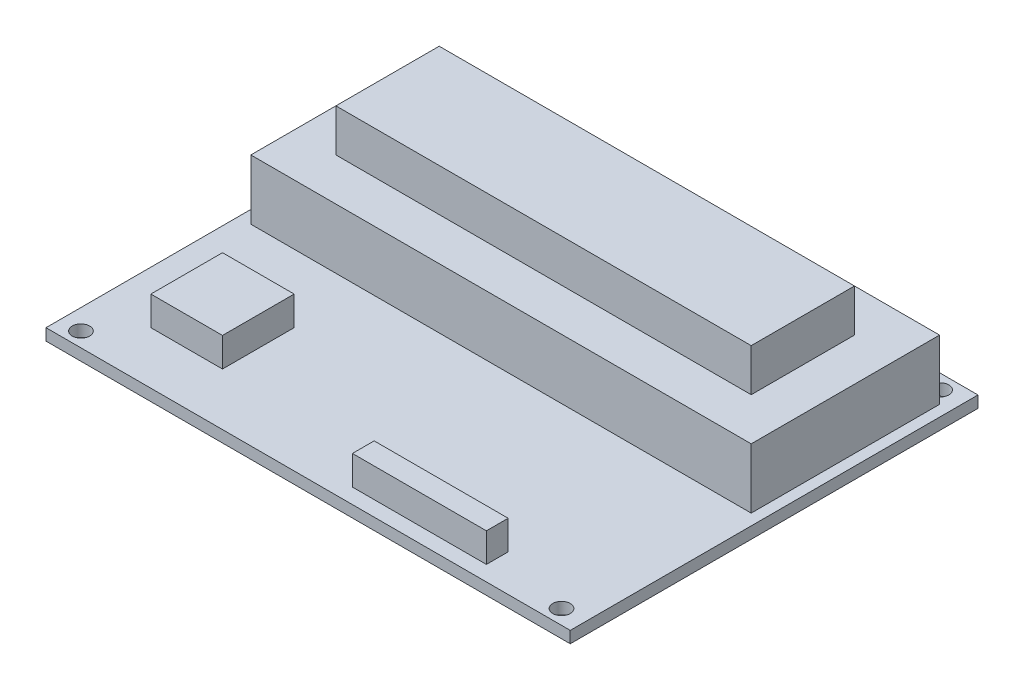
ISO-10303-21;
HEADER;
FILE_DESCRIPTION(('STEP AP214'),'2;1');
FILE_NAME('part.step','',(''),(''),'','','');
FILE_SCHEMA(('AUTOMOTIVE_DESIGN { 1 0 10303 214 1 1 1 1 }'));
ENDSEC;
DATA;
#1=APPLICATION_CONTEXT('core data for automotive mechanical design processes');
#2=APPLICATION_PROTOCOL_DEFINITION('international standard','automotive_design',2000,#1);
#3=PRODUCT_CONTEXT('',#1,'mechanical');
#4=PRODUCT('Part','Part','',(#3));
#5=PRODUCT_RELATED_PRODUCT_CATEGORY('part','',(#4));
#6=PRODUCT_DEFINITION_FORMATION('','',#4);
#7=PRODUCT_DEFINITION_CONTEXT('part definition',#1,'design');
#8=PRODUCT_DEFINITION('design','',#6,#7);
#9=PRODUCT_DEFINITION_SHAPE('','',#8);
#10=(LENGTH_UNIT() NAMED_UNIT(*) SI_UNIT(.MILLI.,.METRE.));
#11=(NAMED_UNIT(*) PLANE_ANGLE_UNIT() SI_UNIT($,.RADIAN.));
#12=(NAMED_UNIT(*) SI_UNIT($,.STERADIAN.) SOLID_ANGLE_UNIT());
#13=UNCERTAINTY_MEASURE_WITH_UNIT(LENGTH_MEASURE(1.E-05),#10,'distance_accuracy_value','');
#14=(GEOMETRIC_REPRESENTATION_CONTEXT(3) GLOBAL_UNCERTAINTY_ASSIGNED_CONTEXT((#13)) GLOBAL_UNIT_ASSIGNED_CONTEXT((#10,
#11,#12)) REPRESENTATION_CONTEXT('',''));
#15=CARTESIAN_POINT('',(0.,0.,0.));
#16=DIRECTION('',(0.,0.,1.));
#17=DIRECTION('',(1.,0.,0.));
#18=AXIS2_PLACEMENT_3D('',#15,#16,#17);
#19=CARTESIAN_POINT('',(0.,2.,0.));
#20=DIRECTION('',(0.,1.,0.));
#21=DIRECTION('',(0.,0.,1.));
#22=AXIS2_PLACEMENT_3D('',#19,#20,#21);
#23=PLANE('',#22);
#24=DIRECTION('',(1.,0.,0.));
#25=VECTOR('',#24,1.);
#26=CARTESIAN_POINT('',(-36.,2.,26.));
#27=LINE('',#26,#25);
#28=CARTESIAN_POINT('',(-36.,2.,26.));
#29=VERTEX_POINT('',#28);
#30=CARTESIAN_POINT('',(-23.7,2.,26.));
#31=VERTEX_POINT('',#30);
#32=EDGE_CURVE('E245',#29,#31,#27,.T.);
#33=ORIENTED_EDGE('',*,*,#32,.F.);
#34=DIRECTION('',(0.,0.,1.));
#35=VECTOR('',#34,1.);
#36=CARTESIAN_POINT('',(-36.,2.,13.7));
#37=LINE('',#36,#35);
#38=CARTESIAN_POINT('',(-36.,2.,13.7));
#39=VERTEX_POINT('',#38);
#40=EDGE_CURVE('E231',#39,#29,#37,.T.);
#41=ORIENTED_EDGE('',*,*,#40,.F.);
#42=DIRECTION('',(-1.,0.,0.));
#43=VECTOR('',#42,1.);
#44=CARTESIAN_POINT('',(-36.,2.,13.7));
#45=LINE('',#44,#43);
#46=CARTESIAN_POINT('',(-23.7,2.,13.7));
#47=VERTEX_POINT('',#46);
#48=EDGE_CURVE('E236',#47,#39,#45,.T.);
#49=ORIENTED_EDGE('',*,*,#48,.F.);
#50=DIRECTION('',(0.,0.,-1.));
#51=VECTOR('',#50,1.);
#52=CARTESIAN_POINT('',(-23.7,2.,13.7));
#53=LINE('',#52,#51);
#54=EDGE_CURVE('E247',#31,#47,#53,.T.);
#55=ORIENTED_EDGE('',*,*,#54,.F.);
#56=EDGE_LOOP('',(#33,#41,#49,#55));
#57=FACE_BOUND('',#56,.T.);
#58=DIRECTION('',(-1.,0.,0.));
#59=VECTOR('',#58,1.);
#60=CARTESIAN_POINT('',(28.,2.,28.6613439853056));
#61=LINE('',#60,#59);
#62=CARTESIAN_POINT('',(28.,2.,28.6613439853056));
#63=VERTEX_POINT('',#62);
#64=CARTESIAN_POINT('',(5.00000000000001,2.,28.6613439853056));
#65=VERTEX_POINT('',#64);
#66=EDGE_CURVE('E274',#63,#65,#61,.T.);
#67=ORIENTED_EDGE('',*,*,#66,.F.);
#68=DIRECTION('',(0.,0.,-1.));
#69=VECTOR('',#68,1.);
#70=CARTESIAN_POINT('',(28.,2.,28.6613439853056));
#71=LINE('',#70,#69);
#72=CARTESIAN_POINT('',(28.,2.,32.3950858230546));
#73=VERTEX_POINT('',#72);
#74=EDGE_CURVE('E260',#73,#63,#71,.T.);
#75=ORIENTED_EDGE('',*,*,#74,.F.);
#76=DIRECTION('',(1.,0.,0.));
#77=VECTOR('',#76,1.);
#78=CARTESIAN_POINT('',(28.,2.,32.3950858230546));
#79=LINE('',#78,#77);
#80=CARTESIAN_POINT('',(5.00000000000001,2.,32.3950858230546));
#81=VERTEX_POINT('',#80);
#82=EDGE_CURVE('E265',#81,#73,#79,.T.);
#83=ORIENTED_EDGE('',*,*,#82,.F.);
#84=DIRECTION('',(0.,0.,1.));
#85=VECTOR('',#84,1.);
#86=CARTESIAN_POINT('',(5.00000000000001,2.,28.6613439853056));
#87=LINE('',#86,#85);
#88=EDGE_CURVE('E276',#65,#81,#87,.T.);
#89=ORIENTED_EDGE('',*,*,#88,.F.);
#90=EDGE_LOOP('',(#67,#75,#83,#89));
#91=FACE_BOUND('',#90,.T.);
#92=DIRECTION('',(0.,0.,-1.));
#93=VECTOR('',#92,1.);
#94=CARTESIAN_POINT('',(45.,2.,-35.));
#95=LINE('',#94,#93);
#96=CARTESIAN_POINT('',(45.,2.,35.));
#97=VERTEX_POINT('',#96);
#98=CARTESIAN_POINT('',(45.,2.,-35.));
#99=VERTEX_POINT('',#98);
#100=EDGE_CURVE('E314',#97,#99,#95,.T.);
#101=ORIENTED_EDGE('',*,*,#100,.T.);
#102=DIRECTION('',(-1.,0.,0.));
#103=VECTOR('',#102,1.);
#104=CARTESIAN_POINT('',(-45.,2.,-35.));
#105=LINE('',#104,#103);
#106=CARTESIAN_POINT('',(-45.,2.,-35.));
#107=VERTEX_POINT('',#106);
#108=EDGE_CURVE('E317',#99,#107,#105,.T.);
#109=ORIENTED_EDGE('',*,*,#108,.T.);
#110=DIRECTION('',(0.,0.,1.));
#111=VECTOR('',#110,1.);
#112=CARTESIAN_POINT('',(-45.,2.,-35.));
#113=LINE('',#112,#111);
#114=CARTESIAN_POINT('',(-45.,2.,35.));
#115=VERTEX_POINT('',#114);
#116=EDGE_CURVE('E320',#107,#115,#113,.T.);
#117=ORIENTED_EDGE('',*,*,#116,.T.);
#118=DIRECTION('',(1.,0.,0.));
#119=VECTOR('',#118,1.);
#120=CARTESIAN_POINT('',(-45.,2.,35.));
#121=LINE('',#120,#119);
#122=EDGE_CURVE('E322',#115,#97,#121,.T.);
#123=ORIENTED_EDGE('',*,*,#122,.T.);
#124=EDGE_LOOP('',(#101,#109,#117,#123));
#125=FACE_BOUND('',#124,.T.);
#126=CARTESIAN_POINT('',(-41.5,2.,32.5));
#127=DIRECTION('',(0.,1.,0.));
#128=DIRECTION('',(0.,0.,1.));
#129=AXIS2_PLACEMENT_3D('',#126,#127,#128);
#130=CIRCLE('',#129,1.5);
#131=CARTESIAN_POINT('',(-41.5,2.,34.));
#132=VERTEX_POINT('',#131);
#133=EDGE_CURVE('E293',#132,#132,#130,.T.);
#134=ORIENTED_EDGE('',*,*,#133,.F.);
#135=EDGE_LOOP('',(#134));
#136=FACE_BOUND('',#135,.T.);
#137=CARTESIAN_POINT('',(41.,2.,32.5));
#138=DIRECTION('',(0.,1.,0.));
#139=DIRECTION('',(0.,0.,1.));
#140=AXIS2_PLACEMENT_3D('',#137,#138,#139);
#141=CIRCLE('',#140,1.5);
#142=CARTESIAN_POINT('',(41.,2.,34.));
#143=VERTEX_POINT('',#142);
#144=EDGE_CURVE('E294',#143,#143,#141,.T.);
#145=ORIENTED_EDGE('',*,*,#144,.F.);
#146=EDGE_LOOP('',(#145));
#147=FACE_BOUND('',#146,.T.);
#148=CARTESIAN_POINT('',(41.,2.,-32.5));
#149=DIRECTION('',(0.,1.,0.));
#150=DIRECTION('',(0.,0.,1.));
#151=AXIS2_PLACEMENT_3D('',#148,#149,#150);
#152=CIRCLE('',#151,1.5);
#153=CARTESIAN_POINT('',(41.,2.,-31.));
#154=VERTEX_POINT('',#153);
#155=EDGE_CURVE('E300',#154,#154,#152,.T.);
#156=ORIENTED_EDGE('',*,*,#155,.F.);
#157=EDGE_LOOP('',(#156));
#158=FACE_BOUND('',#157,.T.);
#159=CARTESIAN_POINT('',(-41.5,2.,-32.5));
#160=DIRECTION('',(0.,1.,0.));
#161=DIRECTION('',(0.,0.,1.));
#162=AXIS2_PLACEMENT_3D('',#159,#160,#161);
#163=CIRCLE('',#162,1.5);
#164=CARTESIAN_POINT('',(-41.5,2.,-31.));
#165=VERTEX_POINT('',#164);
#166=EDGE_CURVE('E289',#165,#165,#163,.T.);
#167=ORIENTED_EDGE('',*,*,#166,.F.);
#168=EDGE_LOOP('',(#167));
#169=FACE_BOUND('',#168,.T.);
#170=DIRECTION('',(1.,0.,0.));
#171=VECTOR('',#170,1.);
#172=CARTESIAN_POINT('',(-42.8,2.,2.03518065147072));
#173=LINE('',#172,#171);
#174=CARTESIAN_POINT('',(-42.8,2.,2.03518065147072));
#175=VERTEX_POINT('',#174);
#176=CARTESIAN_POINT('',(43.1,2.,2.03518065147072));
#177=VERTEX_POINT('',#176);
#178=EDGE_CURVE('E373',#175,#177,#173,.T.);
#179=ORIENTED_EDGE('',*,*,#178,.F.);
#180=DIRECTION('',(0.,0.,1.));
#181=VECTOR('',#180,1.);
#182=CARTESIAN_POINT('',(-42.8,2.,-30.3));
#183=LINE('',#182,#181);
#184=CARTESIAN_POINT('',(-42.8,2.,-30.3));
#185=VERTEX_POINT('',#184);
#186=EDGE_CURVE('E197',#185,#175,#183,.T.);
#187=ORIENTED_EDGE('',*,*,#186,.F.);
#188=DIRECTION('',(-1.,0.,0.));
#189=VECTOR('',#188,1.);
#190=CARTESIAN_POINT('',(-42.8,2.,-30.3));
#191=LINE('',#190,#189);
#192=CARTESIAN_POINT('',(43.1,2.,-30.3));
#193=VERTEX_POINT('',#192);
#194=EDGE_CURVE('E193',#193,#185,#191,.T.);
#195=ORIENTED_EDGE('',*,*,#194,.F.);
#196=DIRECTION('',(0.,0.,-1.));
#197=VECTOR('',#196,1.);
#198=CARTESIAN_POINT('',(43.1,2.,-30.3));
#199=LINE('',#198,#197);
#200=EDGE_CURVE('E375',#177,#193,#199,.T.);
#201=ORIENTED_EDGE('',*,*,#200,.F.);
#202=EDGE_LOOP('',(#179,#187,#195,#201));
#203=FACE_BOUND('',#202,.T.);
#204=ADVANCED_FACE('F38',(#57,#91,#125,#136,#147,#158,#169,#203),#23,.T.);
#205=CARTESIAN_POINT('',(45.,2.,-35.));
#206=DIRECTION('',(-1.,0.,0.));
#207=DIRECTION('',(0.,0.,1.));
#208=AXIS2_PLACEMENT_3D('',#205,#206,#207);
#209=PLANE('',#208);
#210=DIRECTION('',(0.,0.,-1.));
#211=VECTOR('',#210,1.);
#212=CARTESIAN_POINT('',(45.,0.,-35.));
#213=LINE('',#212,#211);
#214=CARTESIAN_POINT('',(45.,0.,35.));
#215=VERTEX_POINT('',#214);
#216=CARTESIAN_POINT('',(45.,0.,-35.));
#217=VERTEX_POINT('',#216);
#218=EDGE_CURVE('E311',#215,#217,#213,.T.);
#219=ORIENTED_EDGE('',*,*,#218,.T.);
#220=DIRECTION('',(0.,-1.,0.));
#221=VECTOR('',#220,1.);
#222=CARTESIAN_POINT('',(45.,2.,-35.));
#223=LINE('',#222,#221);
#224=EDGE_CURVE('E46',#99,#217,#223,.T.);
#225=ORIENTED_EDGE('',*,*,#224,.F.);
#226=ORIENTED_EDGE('',*,*,#100,.F.);
#227=DIRECTION('',(0.,-1.,0.));
#228=VECTOR('',#227,1.);
#229=CARTESIAN_POINT('',(45.,2.,35.));
#230=LINE('',#229,#228);
#231=EDGE_CURVE('E324',#97,#215,#230,.T.);
#232=ORIENTED_EDGE('',*,*,#231,.T.);
#233=EDGE_LOOP('',(#219,#225,#226,#232));
#234=FACE_BOUND('',#233,.T.);
#235=ADVANCED_FACE('F40',(#234),#209,.F.);
#236=CARTESIAN_POINT('',(-45.,2.,-35.));
#237=DIRECTION('',(0.,0.,1.));
#238=DIRECTION('',(1.,0.,0.));
#239=AXIS2_PLACEMENT_3D('',#236,#237,#238);
#240=PLANE('',#239);
#241=DIRECTION('',(-1.,0.,0.));
#242=VECTOR('',#241,1.);
#243=CARTESIAN_POINT('',(-45.,0.,-35.));
#244=LINE('',#243,#242);
#245=CARTESIAN_POINT('',(-45.,0.,-35.));
#246=VERTEX_POINT('',#245);
#247=EDGE_CURVE('E327',#217,#246,#244,.T.);
#248=ORIENTED_EDGE('',*,*,#247,.T.);
#249=DIRECTION('',(0.,-1.,0.));
#250=VECTOR('',#249,1.);
#251=CARTESIAN_POINT('',(-45.,2.,-35.));
#252=LINE('',#251,#250);
#253=EDGE_CURVE('E337',#107,#246,#252,.T.);
#254=ORIENTED_EDGE('',*,*,#253,.F.);
#255=ORIENTED_EDGE('',*,*,#108,.F.);
#256=ORIENTED_EDGE('',*,*,#224,.T.);
#257=EDGE_LOOP('',(#248,#254,#255,#256));
#258=FACE_BOUND('',#257,.T.);
#259=ADVANCED_FACE('F342',(#258),#240,.F.);
#260=CARTESIAN_POINT('',(-45.,2.,-35.));
#261=DIRECTION('',(1.,0.,0.));
#262=DIRECTION('',(0.,0.,-1.));
#263=AXIS2_PLACEMENT_3D('',#260,#261,#262);
#264=PLANE('',#263);
#265=DIRECTION('',(0.,0.,1.));
#266=VECTOR('',#265,1.);
#267=CARTESIAN_POINT('',(-45.,0.,-35.));
#268=LINE('',#267,#266);
#269=CARTESIAN_POINT('',(-45.,0.,35.));
#270=VERTEX_POINT('',#269);
#271=EDGE_CURVE('E329',#246,#270,#268,.T.);
#272=ORIENTED_EDGE('',*,*,#271,.T.);
#273=DIRECTION('',(0.,-1.,0.));
#274=VECTOR('',#273,1.);
#275=CARTESIAN_POINT('',(-45.,2.,35.));
#276=LINE('',#275,#274);
#277=EDGE_CURVE('E334',#115,#270,#276,.T.);
#278=ORIENTED_EDGE('',*,*,#277,.F.);
#279=ORIENTED_EDGE('',*,*,#116,.F.);
#280=ORIENTED_EDGE('',*,*,#253,.T.);
#281=EDGE_LOOP('',(#272,#278,#279,#280));
#282=FACE_BOUND('',#281,.T.);
#283=ADVANCED_FACE('F354',(#282),#264,.F.);
#284=CARTESIAN_POINT('',(-45.,2.,35.));
#285=DIRECTION('',(0.,0.,-1.));
#286=DIRECTION('',(-1.,0.,0.));
#287=AXIS2_PLACEMENT_3D('',#284,#285,#286);
#288=PLANE('',#287);
#289=DIRECTION('',(1.,0.,0.));
#290=VECTOR('',#289,1.);
#291=CARTESIAN_POINT('',(-45.,0.,35.));
#292=LINE('',#291,#290);
#293=EDGE_CURVE('E318',#270,#215,#292,.T.);
#294=ORIENTED_EDGE('',*,*,#293,.T.);
#295=ORIENTED_EDGE('',*,*,#231,.F.);
#296=ORIENTED_EDGE('',*,*,#122,.F.);
#297=ORIENTED_EDGE('',*,*,#277,.T.);
#298=EDGE_LOOP('',(#294,#295,#296,#297));
#299=FACE_BOUND('',#298,.T.);
#300=ADVANCED_FACE('F358',(#299),#288,.F.);
#301=CARTESIAN_POINT('',(0.,0.,0.));
#302=DIRECTION('',(0.,1.,0.));
#303=DIRECTION('',(0.,0.,1.));
#304=AXIS2_PLACEMENT_3D('',#301,#302,#303);
#305=PLANE('',#304);
#306=CARTESIAN_POINT('',(-41.5,0.,-32.5));
#307=DIRECTION('',(0.,1.,0.));
#308=DIRECTION('',(0.,0.,1.));
#309=AXIS2_PLACEMENT_3D('',#306,#307,#308);
#310=CIRCLE('',#309,1.5);
#311=CARTESIAN_POINT('',(-41.5,0.,-31.));
#312=VERTEX_POINT('',#311);
#313=EDGE_CURVE('E303',#312,#312,#310,.T.);
#314=ORIENTED_EDGE('',*,*,#313,.T.);
#315=EDGE_LOOP('',(#314));
#316=FACE_BOUND('',#315,.T.);
#317=CARTESIAN_POINT('',(41.,0.,-32.5));
#318=DIRECTION('',(0.,1.,0.));
#319=DIRECTION('',(0.,0.,1.));
#320=AXIS2_PLACEMENT_3D('',#317,#318,#319);
#321=CIRCLE('',#320,1.5);
#322=CARTESIAN_POINT('',(41.,0.,-31.));
#323=VERTEX_POINT('',#322);
#324=EDGE_CURVE('E297',#323,#323,#321,.T.);
#325=ORIENTED_EDGE('',*,*,#324,.T.);
#326=EDGE_LOOP('',(#325));
#327=FACE_BOUND('',#326,.T.);
#328=CARTESIAN_POINT('',(41.,0.,32.5));
#329=DIRECTION('',(0.,1.,0.));
#330=DIRECTION('',(0.,0.,1.));
#331=AXIS2_PLACEMENT_3D('',#328,#329,#330);
#332=CIRCLE('',#331,1.5);
#333=CARTESIAN_POINT('',(41.,0.,34.));
#334=VERTEX_POINT('',#333);
#335=EDGE_CURVE('E290',#334,#334,#332,.T.);
#336=ORIENTED_EDGE('',*,*,#335,.T.);
#337=EDGE_LOOP('',(#336));
#338=FACE_BOUND('',#337,.T.);
#339=CARTESIAN_POINT('',(-41.5,0.,32.5));
#340=DIRECTION('',(0.,1.,0.));
#341=DIRECTION('',(0.,0.,1.));
#342=AXIS2_PLACEMENT_3D('',#339,#340,#341);
#343=CIRCLE('',#342,1.5);
#344=CARTESIAN_POINT('',(-41.5,0.,34.));
#345=VERTEX_POINT('',#344);
#346=EDGE_CURVE('E308',#345,#345,#343,.T.);
#347=ORIENTED_EDGE('',*,*,#346,.T.);
#348=EDGE_LOOP('',(#347));
#349=FACE_BOUND('',#348,.T.);
#350=ORIENTED_EDGE('',*,*,#218,.F.);
#351=ORIENTED_EDGE('',*,*,#293,.F.);
#352=ORIENTED_EDGE('',*,*,#271,.F.);
#353=ORIENTED_EDGE('',*,*,#247,.F.);
#354=EDGE_LOOP('',(#350,#351,#352,#353));
#355=FACE_BOUND('',#354,.T.);
#356=ADVANCED_FACE('F350',(#316,#327,#338,#349,#355),#305,.F.);
#357=CARTESIAN_POINT('',(-41.5,0.,32.5));
#358=DIRECTION('',(0.,1.,0.));
#359=DIRECTION('',(0.,0.,1.));
#360=AXIS2_PLACEMENT_3D('',#357,#358,#359);
#361=CYLINDRICAL_SURFACE('',#360,1.5);
#362=ORIENTED_EDGE('',*,*,#346,.F.);
#363=EDGE_LOOP('',(#362));
#364=FACE_BOUND('',#363,.T.);
#365=ORIENTED_EDGE('',*,*,#133,.T.);
#366=EDGE_LOOP('',(#365));
#367=FACE_BOUND('',#366,.T.);
#368=ADVANCED_FACE('F464',(#364,#367),#361,.F.);
#369=CARTESIAN_POINT('',(41.,0.,32.5));
#370=DIRECTION('',(0.,1.,0.));
#371=DIRECTION('',(0.,0.,1.));
#372=AXIS2_PLACEMENT_3D('',#369,#370,#371);
#373=CYLINDRICAL_SURFACE('',#372,1.5);
#374=ORIENTED_EDGE('',*,*,#335,.F.);
#375=EDGE_LOOP('',(#374));
#376=FACE_BOUND('',#375,.T.);
#377=ORIENTED_EDGE('',*,*,#144,.T.);
#378=EDGE_LOOP('',(#377));
#379=FACE_BOUND('',#378,.T.);
#380=ADVANCED_FACE('F460',(#376,#379),#373,.F.);
#381=CARTESIAN_POINT('',(41.,0.,-32.5));
#382=DIRECTION('',(0.,1.,0.));
#383=DIRECTION('',(0.,0.,1.));
#384=AXIS2_PLACEMENT_3D('',#381,#382,#383);
#385=CYLINDRICAL_SURFACE('',#384,1.5);
#386=ORIENTED_EDGE('',*,*,#324,.F.);
#387=EDGE_LOOP('',(#386));
#388=FACE_BOUND('',#387,.T.);
#389=ORIENTED_EDGE('',*,*,#155,.T.);
#390=EDGE_LOOP('',(#389));
#391=FACE_BOUND('',#390,.T.);
#392=ADVANCED_FACE('F463',(#388,#391),#385,.F.);
#393=CARTESIAN_POINT('',(-41.5,0.,-32.5));
#394=DIRECTION('',(0.,1.,0.));
#395=DIRECTION('',(0.,0.,1.));
#396=AXIS2_PLACEMENT_3D('',#393,#394,#395);
#397=CYLINDRICAL_SURFACE('',#396,1.5);
#398=ORIENTED_EDGE('',*,*,#313,.F.);
#399=EDGE_LOOP('',(#398));
#400=FACE_BOUND('',#399,.T.);
#401=ORIENTED_EDGE('',*,*,#166,.T.);
#402=EDGE_LOOP('',(#401));
#403=FACE_BOUND('',#402,.T.);
#404=ADVANCED_FACE('F458',(#400,#403),#397,.F.);
#405=CARTESIAN_POINT('',(28.,7.,28.6613439853056));
#406=DIRECTION('',(-1.,0.,0.));
#407=DIRECTION('',(0.,0.,1.));
#408=AXIS2_PLACEMENT_3D('',#405,#406,#407);
#409=PLANE('',#408);
#410=ORIENTED_EDGE('',*,*,#74,.T.);
#411=DIRECTION('',(0.,-1.,0.));
#412=VECTOR('',#411,1.);
#413=CARTESIAN_POINT('',(28.,7.,28.6613439853056));
#414=LINE('',#413,#412);
#415=CARTESIAN_POINT('',(28.,7.,28.6613439853056));
#416=VERTEX_POINT('',#415);
#417=EDGE_CURVE('E287',#416,#63,#414,.T.);
#418=ORIENTED_EDGE('',*,*,#417,.F.);
#419=DIRECTION('',(0.,0.,-1.));
#420=VECTOR('',#419,1.);
#421=CARTESIAN_POINT('',(28.,7.,28.6613439853056));
#422=LINE('',#421,#420);
#423=CARTESIAN_POINT('',(28.,7.,32.3950858230546));
#424=VERTEX_POINT('',#423);
#425=EDGE_CURVE('E261',#424,#416,#422,.T.);
#426=ORIENTED_EDGE('',*,*,#425,.F.);
#427=DIRECTION('',(0.,-1.,0.));
#428=VECTOR('',#427,1.);
#429=CARTESIAN_POINT('',(28.,7.,32.3950858230546));
#430=LINE('',#429,#428);
#431=EDGE_CURVE('E271',#424,#73,#430,.T.);
#432=ORIENTED_EDGE('',*,*,#431,.T.);
#433=EDGE_LOOP('',(#410,#418,#426,#432));
#434=FACE_BOUND('',#433,.T.);
#435=ADVANCED_FACE('F454',(#434),#409,.F.);
#436=CARTESIAN_POINT('',(28.,7.,28.6613439853056));
#437=DIRECTION('',(0.,0.,1.));
#438=DIRECTION('',(1.,0.,0.));
#439=AXIS2_PLACEMENT_3D('',#436,#437,#438);
#440=PLANE('',#439);
#441=ORIENTED_EDGE('',*,*,#66,.T.);
#442=DIRECTION('',(0.,-1.,0.));
#443=VECTOR('',#442,1.);
#444=CARTESIAN_POINT('',(5.00000000000001,7.,28.6613439853056));
#445=LINE('',#444,#443);
#446=CARTESIAN_POINT('',(5.00000000000001,7.,28.6613439853056));
#447=VERTEX_POINT('',#446);
#448=EDGE_CURVE('E284',#447,#65,#445,.T.);
#449=ORIENTED_EDGE('',*,*,#448,.F.);
#450=DIRECTION('',(-1.,0.,0.));
#451=VECTOR('',#450,1.);
#452=CARTESIAN_POINT('',(28.,7.,28.6613439853056));
#453=LINE('',#452,#451);
#454=EDGE_CURVE('E264',#416,#447,#453,.T.);
#455=ORIENTED_EDGE('',*,*,#454,.F.);
#456=ORIENTED_EDGE('',*,*,#417,.T.);
#457=EDGE_LOOP('',(#441,#449,#455,#456));
#458=FACE_BOUND('',#457,.T.);
#459=ADVANCED_FACE('F450',(#458),#440,.F.);
#460=CARTESIAN_POINT('',(5.00000000000001,7.,28.6613439853056));
#461=DIRECTION('',(1.,0.,0.));
#462=DIRECTION('',(0.,0.,-1.));
#463=AXIS2_PLACEMENT_3D('',#460,#461,#462);
#464=PLANE('',#463);
#465=ORIENTED_EDGE('',*,*,#88,.T.);
#466=DIRECTION('',(0.,-1.,0.));
#467=VECTOR('',#466,1.);
#468=CARTESIAN_POINT('',(5.00000000000001,7.,32.3950858230546));
#469=LINE('',#468,#467);
#470=CARTESIAN_POINT('',(5.00000000000001,7.,32.3950858230546));
#471=VERTEX_POINT('',#470);
#472=EDGE_CURVE('E282',#471,#81,#469,.T.);
#473=ORIENTED_EDGE('',*,*,#472,.F.);
#474=DIRECTION('',(0.,0.,1.));
#475=VECTOR('',#474,1.);
#476=CARTESIAN_POINT('',(5.00000000000001,7.,28.6613439853056));
#477=LINE('',#476,#475);
#478=EDGE_CURVE('E267',#447,#471,#477,.T.);
#479=ORIENTED_EDGE('',*,*,#478,.F.);
#480=ORIENTED_EDGE('',*,*,#448,.T.);
#481=EDGE_LOOP('',(#465,#473,#479,#480));
#482=FACE_BOUND('',#481,.T.);
#483=ADVANCED_FACE('F446',(#482),#464,.F.);
#484=CARTESIAN_POINT('',(28.,7.,32.3950858230546));
#485=DIRECTION('',(0.,0.,-1.));
#486=DIRECTION('',(-1.,0.,0.));
#487=AXIS2_PLACEMENT_3D('',#484,#485,#486);
#488=PLANE('',#487);
#489=ORIENTED_EDGE('',*,*,#82,.T.);
#490=ORIENTED_EDGE('',*,*,#431,.F.);
#491=DIRECTION('',(1.,0.,0.));
#492=VECTOR('',#491,1.);
#493=CARTESIAN_POINT('',(28.,7.,32.3950858230546));
#494=LINE('',#493,#492);
#495=EDGE_CURVE('E269',#471,#424,#494,.T.);
#496=ORIENTED_EDGE('',*,*,#495,.F.);
#497=ORIENTED_EDGE('',*,*,#472,.T.);
#498=EDGE_LOOP('',(#489,#490,#496,#497));
#499=FACE_BOUND('',#498,.T.);
#500=ADVANCED_FACE('F442',(#499),#488,.F.);
#501=CARTESIAN_POINT('',(0.,7.,0.));
#502=DIRECTION('',(0.,-1.,0.));
#503=DIRECTION('',(0.,0.,-1.));
#504=AXIS2_PLACEMENT_3D('',#501,#502,#503);
#505=PLANE('',#504);
#506=ORIENTED_EDGE('',*,*,#425,.T.);
#507=ORIENTED_EDGE('',*,*,#454,.T.);
#508=ORIENTED_EDGE('',*,*,#478,.T.);
#509=ORIENTED_EDGE('',*,*,#495,.T.);
#510=EDGE_LOOP('',(#506,#507,#508,#509));
#511=FACE_BOUND('',#510,.T.);
#512=ADVANCED_FACE('F438',(#511),#505,.F.);
#513=CARTESIAN_POINT('',(-36.,7.,13.7));
#514=DIRECTION('',(1.,0.,0.));
#515=DIRECTION('',(0.,0.,-1.));
#516=AXIS2_PLACEMENT_3D('',#513,#514,#515);
#517=PLANE('',#516);
#518=ORIENTED_EDGE('',*,*,#40,.T.);
#519=DIRECTION('',(0.,-1.,0.));
#520=VECTOR('',#519,1.);
#521=CARTESIAN_POINT('',(-36.,7.,26.));
#522=LINE('',#521,#520);
#523=CARTESIAN_POINT('',(-36.,7.,26.));
#524=VERTEX_POINT('',#523);
#525=EDGE_CURVE('E258',#524,#29,#522,.T.);
#526=ORIENTED_EDGE('',*,*,#525,.F.);
#527=DIRECTION('',(0.,0.,1.));
#528=VECTOR('',#527,1.);
#529=CARTESIAN_POINT('',(-36.,7.,13.7));
#530=LINE('',#529,#528);
#531=CARTESIAN_POINT('',(-36.,7.,13.7));
#532=VERTEX_POINT('',#531);
#533=EDGE_CURVE('E232',#532,#524,#530,.T.);
#534=ORIENTED_EDGE('',*,*,#533,.F.);
#535=DIRECTION('',(0.,-1.,0.));
#536=VECTOR('',#535,1.);
#537=CARTESIAN_POINT('',(-36.,7.,13.7));
#538=LINE('',#537,#536);
#539=EDGE_CURVE('E242',#532,#39,#538,.T.);
#540=ORIENTED_EDGE('',*,*,#539,.T.);
#541=EDGE_LOOP('',(#518,#526,#534,#540));
#542=FACE_BOUND('',#541,.T.);
#543=ADVANCED_FACE('F434',(#542),#517,.F.);
#544=CARTESIAN_POINT('',(-36.,7.,26.));
#545=DIRECTION('',(0.,0.,-1.));
#546=DIRECTION('',(-1.,0.,0.));
#547=AXIS2_PLACEMENT_3D('',#544,#545,#546);
#548=PLANE('',#547);
#549=ORIENTED_EDGE('',*,*,#32,.T.);
#550=DIRECTION('',(0.,-1.,0.));
#551=VECTOR('',#550,1.);
#552=CARTESIAN_POINT('',(-23.7,7.,26.));
#553=LINE('',#552,#551);
#554=CARTESIAN_POINT('',(-23.7,7.,26.));
#555=VERTEX_POINT('',#554);
#556=EDGE_CURVE('E255',#555,#31,#553,.T.);
#557=ORIENTED_EDGE('',*,*,#556,.F.);
#558=DIRECTION('',(1.,0.,0.));
#559=VECTOR('',#558,1.);
#560=CARTESIAN_POINT('',(-36.,7.,26.));
#561=LINE('',#560,#559);
#562=EDGE_CURVE('E235',#524,#555,#561,.T.);
#563=ORIENTED_EDGE('',*,*,#562,.F.);
#564=ORIENTED_EDGE('',*,*,#525,.T.);
#565=EDGE_LOOP('',(#549,#557,#563,#564));
#566=FACE_BOUND('',#565,.T.);
#567=ADVANCED_FACE('F430',(#566),#548,.F.);
#568=CARTESIAN_POINT('',(-23.7,7.,13.7));
#569=DIRECTION('',(-1.,0.,0.));
#570=DIRECTION('',(0.,0.,1.));
#571=AXIS2_PLACEMENT_3D('',#568,#569,#570);
#572=PLANE('',#571);
#573=ORIENTED_EDGE('',*,*,#54,.T.);
#574=DIRECTION('',(0.,-1.,0.));
#575=VECTOR('',#574,1.);
#576=CARTESIAN_POINT('',(-23.7,7.,13.7));
#577=LINE('',#576,#575);
#578=CARTESIAN_POINT('',(-23.7,7.,13.7));
#579=VERTEX_POINT('',#578);
#580=EDGE_CURVE('E253',#579,#47,#577,.T.);
#581=ORIENTED_EDGE('',*,*,#580,.F.);
#582=DIRECTION('',(0.,0.,-1.));
#583=VECTOR('',#582,1.);
#584=CARTESIAN_POINT('',(-23.7,7.,13.7));
#585=LINE('',#584,#583);
#586=EDGE_CURVE('E238',#555,#579,#585,.T.);
#587=ORIENTED_EDGE('',*,*,#586,.F.);
#588=ORIENTED_EDGE('',*,*,#556,.T.);
#589=EDGE_LOOP('',(#573,#581,#587,#588));
#590=FACE_BOUND('',#589,.T.);
#591=ADVANCED_FACE('F426',(#590),#572,.F.);
#592=CARTESIAN_POINT('',(-36.,7.,13.7));
#593=DIRECTION('',(0.,0.,1.));
#594=DIRECTION('',(1.,0.,0.));
#595=AXIS2_PLACEMENT_3D('',#592,#593,#594);
#596=PLANE('',#595);
#597=ORIENTED_EDGE('',*,*,#48,.T.);
#598=ORIENTED_EDGE('',*,*,#539,.F.);
#599=DIRECTION('',(-1.,0.,0.));
#600=VECTOR('',#599,1.);
#601=CARTESIAN_POINT('',(-36.,7.,13.7));
#602=LINE('',#601,#600);
#603=EDGE_CURVE('E240',#579,#532,#602,.T.);
#604=ORIENTED_EDGE('',*,*,#603,.F.);
#605=ORIENTED_EDGE('',*,*,#580,.T.);
#606=EDGE_LOOP('',(#597,#598,#604,#605));
#607=FACE_BOUND('',#606,.T.);
#608=ADVANCED_FACE('F422',(#607),#596,.F.);
#609=CARTESIAN_POINT('',(0.,7.,0.));
#610=DIRECTION('',(0.,1.,0.));
#611=DIRECTION('',(0.,0.,1.));
#612=AXIS2_PLACEMENT_3D('',#609,#610,#611);
#613=PLANE('',#612);
#614=ORIENTED_EDGE('',*,*,#533,.T.);
#615=ORIENTED_EDGE('',*,*,#562,.T.);
#616=ORIENTED_EDGE('',*,*,#586,.T.);
#617=ORIENTED_EDGE('',*,*,#603,.T.);
#618=EDGE_LOOP('',(#614,#615,#616,#617));
#619=FACE_BOUND('',#618,.T.);
#620=ADVANCED_FACE('F419',(#619),#613,.T.);
#621=CARTESIAN_POINT('',(0.,12.3,0.));
#622=DIRECTION('',(0.,1.,0.));
#623=DIRECTION('',(0.,0.,1.));
#624=AXIS2_PLACEMENT_3D('',#621,#622,#623);
#625=PLANE('',#624);
#626=DIRECTION('',(0.,0.,1.));
#627=VECTOR('',#626,1.);
#628=CARTESIAN_POINT('',(-42.8,12.3,-30.3));
#629=LINE('',#628,#627);
#630=CARTESIAN_POINT('',(-42.8,12.3,-30.3));
#631=VERTEX_POINT('',#630);
#632=CARTESIAN_POINT('',(-42.8,12.3,2.03518065147072));
#633=VERTEX_POINT('',#632);
#634=EDGE_CURVE('E185',#631,#633,#629,.T.);
#635=ORIENTED_EDGE('',*,*,#634,.T.);
#636=DIRECTION('',(1.,0.,0.));
#637=VECTOR('',#636,1.);
#638=CARTESIAN_POINT('',(-42.8,12.3,2.03518065147072));
#639=LINE('',#638,#637);
#640=CARTESIAN_POINT('',(43.1,12.3,2.03518065147072));
#641=VERTEX_POINT('',#640);
#642=EDGE_CURVE('E174',#633,#641,#639,.T.);
#643=ORIENTED_EDGE('',*,*,#642,.T.);
#644=DIRECTION('',(0.,0.,-1.));
#645=VECTOR('',#644,1.);
#646=CARTESIAN_POINT('',(43.1,12.3,-30.3));
#647=LINE('',#646,#645);
#648=CARTESIAN_POINT('',(43.1,12.3,-30.3));
#649=VERTEX_POINT('',#648);
#650=EDGE_CURVE('E184',#641,#649,#647,.T.);
#651=ORIENTED_EDGE('',*,*,#650,.T.);
#652=DIRECTION('',(-1.,0.,0.));
#653=VECTOR('',#652,1.);
#654=CARTESIAN_POINT('',(-42.8,12.3,-30.3));
#655=LINE('',#654,#653);
#656=EDGE_CURVE('E189',#649,#631,#655,.T.);
#657=ORIENTED_EDGE('',*,*,#656,.T.);
#658=EDGE_LOOP('',(#635,#643,#651,#657));
#659=FACE_BOUND('',#658,.T.);
#660=DIRECTION('',(0.,0.,1.));
#661=VECTOR('',#660,1.);
#662=CARTESIAN_POINT('',(-35.5,12.3,-23.));
#663=LINE('',#662,#661);
#664=CARTESIAN_POINT('',(-35.5,12.3,-23.));
#665=VERTEX_POINT('',#664);
#666=CARTESIAN_POINT('',(-35.5,12.3,-5.26481934852927));
#667=VERTEX_POINT('',#666);
#668=EDGE_CURVE('E61',#665,#667,#663,.T.);
#669=ORIENTED_EDGE('',*,*,#668,.F.);
#670=DIRECTION('',(-1.,0.,0.));
#671=VECTOR('',#670,1.);
#672=CARTESIAN_POINT('',(-35.5,12.3,-23.));
#673=LINE('',#672,#671);
#674=CARTESIAN_POINT('',(35.8,12.3,-23.));
#675=VERTEX_POINT('',#674);
#676=EDGE_CURVE('E11',#675,#665,#673,.T.);
#677=ORIENTED_EDGE('',*,*,#676,.F.);
#678=DIRECTION('',(0.,0.,-1.));
#679=VECTOR('',#678,1.);
#680=CARTESIAN_POINT('',(35.8,12.3,-23.));
#681=LINE('',#680,#679);
#682=CARTESIAN_POINT('',(35.8,12.3,-5.26481934852927));
#683=VERTEX_POINT('',#682);
#684=EDGE_CURVE('E199',#683,#675,#681,.T.);
#685=ORIENTED_EDGE('',*,*,#684,.F.);
#686=DIRECTION('',(1.,0.,0.));
#687=VECTOR('',#686,1.);
#688=CARTESIAN_POINT('',(-35.5,12.3,-5.26481934852927));
#689=LINE('',#688,#687);
#690=EDGE_CURVE('E202',#667,#683,#689,.T.);
#691=ORIENTED_EDGE('',*,*,#690,.F.);
#692=EDGE_LOOP('',(#669,#677,#685,#691));
#693=FACE_BOUND('',#692,.T.);
#694=ADVANCED_FACE('F188',(#659,#693),#625,.T.);
#695=CARTESIAN_POINT('',(-42.8,12.3,-30.3));
#696=DIRECTION('',(1.,0.,0.));
#697=DIRECTION('',(0.,0.,-1.));
#698=AXIS2_PLACEMENT_3D('',#695,#696,#697);
#699=PLANE('',#698);
#700=ORIENTED_EDGE('',*,*,#186,.T.);
#701=DIRECTION('',(0.,-1.,0.));
#702=VECTOR('',#701,1.);
#703=CARTESIAN_POINT('',(-42.8,12.3,2.03518065147072));
#704=LINE('',#703,#702);
#705=EDGE_CURVE('E178',#633,#175,#704,.T.);
#706=ORIENTED_EDGE('',*,*,#705,.F.);
#707=ORIENTED_EDGE('',*,*,#634,.F.);
#708=DIRECTION('',(0.,-1.,0.));
#709=VECTOR('',#708,1.);
#710=CARTESIAN_POINT('',(-42.8,12.3,-30.3));
#711=LINE('',#710,#709);
#712=EDGE_CURVE('E382',#631,#185,#711,.T.);
#713=ORIENTED_EDGE('',*,*,#712,.T.);
#714=EDGE_LOOP('',(#700,#706,#707,#713));
#715=FACE_BOUND('',#714,.T.);
#716=ADVANCED_FACE('F195',(#715),#699,.F.);
#717=CARTESIAN_POINT('',(-42.8,12.3,2.03518065147072));
#718=DIRECTION('',(0.,0.,-1.));
#719=DIRECTION('',(-1.,0.,0.));
#720=AXIS2_PLACEMENT_3D('',#717,#718,#719);
#721=PLANE('',#720);
#722=ORIENTED_EDGE('',*,*,#178,.T.);
#723=DIRECTION('',(0.,-1.,0.));
#724=VECTOR('',#723,1.);
#725=CARTESIAN_POINT('',(43.1,12.3,2.03518065147072));
#726=LINE('',#725,#724);
#727=EDGE_CURVE('E181',#641,#177,#726,.T.);
#728=ORIENTED_EDGE('',*,*,#727,.F.);
#729=ORIENTED_EDGE('',*,*,#642,.F.);
#730=ORIENTED_EDGE('',*,*,#705,.T.);
#731=EDGE_LOOP('',(#722,#728,#729,#730));
#732=FACE_BOUND('',#731,.T.);
#733=ADVANCED_FACE('F176',(#732),#721,.F.);
#734=CARTESIAN_POINT('',(43.1,12.3,-30.3));
#735=DIRECTION('',(-1.,0.,0.));
#736=DIRECTION('',(0.,0.,1.));
#737=AXIS2_PLACEMENT_3D('',#734,#735,#736);
#738=PLANE('',#737);
#739=ORIENTED_EDGE('',*,*,#200,.T.);
#740=DIRECTION('',(0.,-1.,0.));
#741=VECTOR('',#740,1.);
#742=CARTESIAN_POINT('',(43.1,12.3,-30.3));
#743=LINE('',#742,#741);
#744=EDGE_CURVE('E53',#649,#193,#743,.T.);
#745=ORIENTED_EDGE('',*,*,#744,.F.);
#746=ORIENTED_EDGE('',*,*,#650,.F.);
#747=ORIENTED_EDGE('',*,*,#727,.T.);
#748=EDGE_LOOP('',(#739,#745,#746,#747));
#749=FACE_BOUND('',#748,.T.);
#750=ADVANCED_FACE('F385',(#749),#738,.F.);
#751=CARTESIAN_POINT('',(-42.8,12.3,-30.3));
#752=DIRECTION('',(0.,0.,1.));
#753=DIRECTION('',(1.,0.,0.));
#754=AXIS2_PLACEMENT_3D('',#751,#752,#753);
#755=PLANE('',#754);
#756=ORIENTED_EDGE('',*,*,#194,.T.);
#757=ORIENTED_EDGE('',*,*,#712,.F.);
#758=ORIENTED_EDGE('',*,*,#656,.F.);
#759=ORIENTED_EDGE('',*,*,#744,.T.);
#760=EDGE_LOOP('',(#756,#757,#758,#759));
#761=FACE_BOUND('',#760,.T.);
#762=ADVANCED_FACE('F386',(#761),#755,.F.);
#763=CARTESIAN_POINT('',(0.,19.6,0.));
#764=DIRECTION('',(0.,1.,0.));
#765=DIRECTION('',(0.,0.,1.));
#766=AXIS2_PLACEMENT_3D('',#763,#764,#765);
#767=PLANE('',#766);
#768=DIRECTION('',(0.,0.,1.));
#769=VECTOR('',#768,1.);
#770=CARTESIAN_POINT('',(-35.5,19.6,-23.));
#771=LINE('',#770,#769);
#772=CARTESIAN_POINT('',(-35.5,19.6,-23.));
#773=VERTEX_POINT('',#772);
#774=CARTESIAN_POINT('',(-35.5,19.6,-5.26481934852927));
#775=VERTEX_POINT('',#774);
#776=EDGE_CURVE('E210',#773,#775,#771,.T.);
#777=ORIENTED_EDGE('',*,*,#776,.T.);
#778=DIRECTION('',(1.,0.,0.));
#779=VECTOR('',#778,1.);
#780=CARTESIAN_POINT('',(-35.5,19.6,-5.26481934852927));
#781=LINE('',#780,#779);
#782=CARTESIAN_POINT('',(35.8,19.6,-5.26481934852927));
#783=VERTEX_POINT('',#782);
#784=EDGE_CURVE('E213',#775,#783,#781,.T.);
#785=ORIENTED_EDGE('',*,*,#784,.T.);
#786=DIRECTION('',(0.,0.,-1.));
#787=VECTOR('',#786,1.);
#788=CARTESIAN_POINT('',(35.8,19.6,-23.));
#789=LINE('',#788,#787);
#790=CARTESIAN_POINT('',(35.8,19.6,-23.));
#791=VERTEX_POINT('',#790);
#792=EDGE_CURVE('E215',#783,#791,#789,.T.);
#793=ORIENTED_EDGE('',*,*,#792,.T.);
#794=DIRECTION('',(-1.,0.,0.));
#795=VECTOR('',#794,1.);
#796=CARTESIAN_POINT('',(-35.5,19.6,-23.));
#797=LINE('',#796,#795);
#798=EDGE_CURVE('E217',#791,#773,#797,.T.);
#799=ORIENTED_EDGE('',*,*,#798,.T.);
#800=EDGE_LOOP('',(#777,#785,#793,#799));
#801=FACE_BOUND('',#800,.T.);
#802=ADVANCED_FACE('F388',(#801),#767,.T.);
#803=CARTESIAN_POINT('',(-35.5,19.6,-23.));
#804=DIRECTION('',(0.,0.,1.));
#805=DIRECTION('',(1.,0.,0.));
#806=AXIS2_PLACEMENT_3D('',#803,#804,#805);
#807=PLANE('',#806);
#808=DIRECTION('',(0.,-1.,0.));
#809=VECTOR('',#808,1.);
#810=CARTESIAN_POINT('',(35.8,19.6,-23.));
#811=LINE('',#810,#809);
#812=EDGE_CURVE('E222',#791,#675,#811,.T.);
#813=ORIENTED_EDGE('',*,*,#812,.T.);
#814=ORIENTED_EDGE('',*,*,#676,.T.);
#815=DIRECTION('',(0.,-1.,0.));
#816=VECTOR('',#815,1.);
#817=CARTESIAN_POINT('',(-35.5,19.6,-23.));
#818=LINE('',#817,#816);
#819=EDGE_CURVE('E219',#773,#665,#818,.T.);
#820=ORIENTED_EDGE('',*,*,#819,.F.);
#821=ORIENTED_EDGE('',*,*,#798,.F.);
#822=EDGE_LOOP('',(#813,#814,#820,#821));
#823=FACE_BOUND('',#822,.T.);
#824=ADVANCED_FACE('F394',(#823),#807,.F.);
#825=CARTESIAN_POINT('',(35.8,19.6,-23.));
#826=DIRECTION('',(-1.,0.,0.));
#827=DIRECTION('',(0.,0.,1.));
#828=AXIS2_PLACEMENT_3D('',#825,#826,#827);
#829=PLANE('',#828);
#830=DIRECTION('',(0.,-1.,0.));
#831=VECTOR('',#830,1.);
#832=CARTESIAN_POINT('',(35.8,19.6,-5.26481934852927));
#833=LINE('',#832,#831);
#834=EDGE_CURVE('E225',#783,#683,#833,.T.);
#835=ORIENTED_EDGE('',*,*,#834,.T.);
#836=ORIENTED_EDGE('',*,*,#684,.T.);
#837=ORIENTED_EDGE('',*,*,#812,.F.);
#838=ORIENTED_EDGE('',*,*,#792,.F.);
#839=EDGE_LOOP('',(#835,#836,#837,#838));
#840=FACE_BOUND('',#839,.T.);
#841=ADVANCED_FACE('F406',(#840),#829,.F.);
#842=CARTESIAN_POINT('',(-35.5,19.6,-5.26481934852927));
#843=DIRECTION('',(0.,0.,-1.));
#844=DIRECTION('',(-1.,0.,0.));
#845=AXIS2_PLACEMENT_3D('',#842,#843,#844);
#846=PLANE('',#845);
#847=DIRECTION('',(0.,-1.,0.));
#848=VECTOR('',#847,1.);
#849=CARTESIAN_POINT('',(-35.5,19.6,-5.26481934852927));
#850=LINE('',#849,#848);
#851=EDGE_CURVE('E228',#775,#667,#850,.T.);
#852=ORIENTED_EDGE('',*,*,#851,.T.);
#853=ORIENTED_EDGE('',*,*,#690,.T.);
#854=ORIENTED_EDGE('',*,*,#834,.F.);
#855=ORIENTED_EDGE('',*,*,#784,.F.);
#856=EDGE_LOOP('',(#852,#853,#854,#855));
#857=FACE_BOUND('',#856,.T.);
#858=ADVANCED_FACE('F410',(#857),#846,.F.);
#859=CARTESIAN_POINT('',(-35.5,19.6,-23.));
#860=DIRECTION('',(1.,0.,0.));
#861=DIRECTION('',(0.,0.,-1.));
#862=AXIS2_PLACEMENT_3D('',#859,#860,#861);
#863=PLANE('',#862);
#864=ORIENTED_EDGE('',*,*,#819,.T.);
#865=ORIENTED_EDGE('',*,*,#668,.T.);
#866=ORIENTED_EDGE('',*,*,#851,.F.);
#867=ORIENTED_EDGE('',*,*,#776,.F.);
#868=EDGE_LOOP('',(#864,#865,#866,#867));
#869=FACE_BOUND('',#868,.T.);
#870=ADVANCED_FACE('F414',(#869),#863,.F.);
#871=CLOSED_SHELL('',(#204,#235,#259,#283,#300,#356,#368,#380,#392,#404,#435,#459,#483,#500,
#512,#543,#567,#591,#608,#620,#694,#716,#733,#750,#762,#802,#824,#841,#858,#870));
#872=MANIFOLD_SOLID_BREP('B2',#871);
#873=ADVANCED_BREP_SHAPE_REPRESENTATION('',(#18,#872),#14);
#874=SHAPE_DEFINITION_REPRESENTATION(#9,#873);
ENDSEC;
END-ISO-10303-21;
